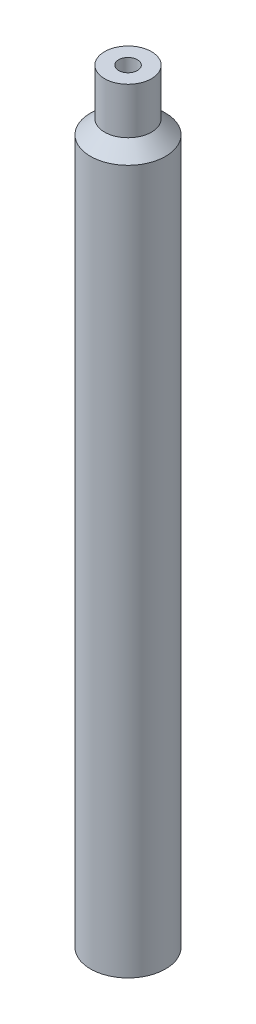
ISO-10303-21;
HEADER;
FILE_DESCRIPTION(('STEP AP214'),'2;1');
FILE_NAME('part.step','',(''),(''),'','','');
FILE_SCHEMA(('AUTOMOTIVE_DESIGN { 1 0 10303 214 1 1 1 1 }'));
ENDSEC;
DATA;
#1=APPLICATION_CONTEXT('core data for automotive mechanical design processes');
#2=APPLICATION_PROTOCOL_DEFINITION('international standard','automotive_design',2000,#1);
#3=PRODUCT_CONTEXT('',#1,'mechanical');
#4=PRODUCT('Part','Part','',(#3));
#5=PRODUCT_RELATED_PRODUCT_CATEGORY('part','',(#4));
#6=PRODUCT_DEFINITION_FORMATION('','',#4);
#7=PRODUCT_DEFINITION_CONTEXT('part definition',#1,'design');
#8=PRODUCT_DEFINITION('design','',#6,#7);
#9=PRODUCT_DEFINITION_SHAPE('','',#8);
#10=(LENGTH_UNIT() NAMED_UNIT(*) SI_UNIT(.MILLI.,.METRE.));
#11=(NAMED_UNIT(*) PLANE_ANGLE_UNIT() SI_UNIT($,.RADIAN.));
#12=(NAMED_UNIT(*) SI_UNIT($,.STERADIAN.) SOLID_ANGLE_UNIT());
#13=UNCERTAINTY_MEASURE_WITH_UNIT(LENGTH_MEASURE(1.E-05),#10,'distance_accuracy_value','');
#14=(GEOMETRIC_REPRESENTATION_CONTEXT(3) GLOBAL_UNCERTAINTY_ASSIGNED_CONTEXT((#13)) GLOBAL_UNIT_ASSIGNED_CONTEXT((#10,
#11,#12)) REPRESENTATION_CONTEXT('',''));
#15=CARTESIAN_POINT('',(0.,0.,0.));
#16=DIRECTION('',(0.,0.,1.));
#17=DIRECTION('',(1.,0.,0.));
#18=AXIS2_PLACEMENT_3D('',#15,#16,#17);
#19=CARTESIAN_POINT('',(0.,-19.3547762804855,0.));
#20=DIRECTION('',(0.,-1.,0.));
#21=DIRECTION('',(0.,0.,-1.));
#22=AXIS2_PLACEMENT_3D('',#19,#20,#21);
#23=CYLINDRICAL_SURFACE('',#22,5.);
#24=CARTESIAN_POINT('',(0.,0.,0.));
#25=DIRECTION('',(0.,-1.,0.));
#26=DIRECTION('',(0.,0.,-1.));
#27=AXIS2_PLACEMENT_3D('',#24,#25,#26);
#28=CIRCLE('',#27,5.);
#29=CARTESIAN_POINT('',(0.,0.,-5.));
#30=VERTEX_POINT('',#29);
#31=EDGE_CURVE('E61',#30,#30,#28,.T.);
#32=ORIENTED_EDGE('',*,*,#31,.T.);
#33=EDGE_LOOP('',(#32));
#34=FACE_BOUND('',#33,.T.);
#35=CARTESIAN_POINT('',(0.,150.,0.));
#36=DIRECTION('',(0.,-1.,0.));
#37=DIRECTION('',(0.,0.,-1.));
#38=AXIS2_PLACEMENT_3D('',#35,#36,#37);
#39=CIRCLE('',#38,5.);
#40=CARTESIAN_POINT('',(0.,150.,-5.));
#41=VERTEX_POINT('',#40);
#42=EDGE_CURVE('E10',#41,#41,#39,.T.);
#43=ORIENTED_EDGE('',*,*,#42,.F.);
#44=EDGE_LOOP('',(#43));
#45=FACE_BOUND('',#44,.T.);
#46=ADVANCED_FACE('F33',(#34,#45),#23,.F.);
#47=CARTESIAN_POINT('',(0.,152.96331719791,0.));
#48=DIRECTION('',(0.,-1.,0.));
#49=DIRECTION('',(0.,0.,-1.));
#50=AXIS2_PLACEMENT_3D('',#47,#48,#49);
#51=CONICAL_SURFACE('',#50,2.,0.791549494643532);
#52=ORIENTED_EDGE('',*,*,#42,.T.);
#53=EDGE_LOOP('',(#52));
#54=FACE_BOUND('',#53,.T.);
#55=CARTESIAN_POINT('',(0.,152.96331719791,0.));
#56=DIRECTION('',(0.,-1.,0.));
#57=DIRECTION('',(0.,0.,-1.));
#58=AXIS2_PLACEMENT_3D('',#55,#56,#57);
#59=CIRCLE('',#58,2.);
#60=CARTESIAN_POINT('',(0.,152.96331719791,-2.));
#61=VERTEX_POINT('',#60);
#62=EDGE_CURVE('E39',#61,#61,#59,.T.);
#63=ORIENTED_EDGE('',*,*,#62,.F.);
#64=EDGE_LOOP('',(#63));
#65=FACE_BOUND('',#64,.T.);
#66=ADVANCED_FACE('F79',(#54,#65),#51,.F.);
#67=CARTESIAN_POINT('',(0.,-19.3547762804855,0.));
#68=DIRECTION('',(0.,-1.,0.));
#69=DIRECTION('',(0.,0.,-1.));
#70=AXIS2_PLACEMENT_3D('',#67,#68,#69);
#71=CYLINDRICAL_SURFACE('',#70,2.);
#72=ORIENTED_EDGE('',*,*,#62,.T.);
#73=EDGE_LOOP('',(#72));
#74=FACE_BOUND('',#73,.T.);
#75=CARTESIAN_POINT('',(0.,162.83711147116,0.));
#76=DIRECTION('',(0.,-1.,0.));
#77=DIRECTION('',(0.,0.,-1.));
#78=AXIS2_PLACEMENT_3D('',#75,#76,#77);
#79=CIRCLE('',#78,2.);
#80=CARTESIAN_POINT('',(0.,162.83711147116,-2.));
#81=VERTEX_POINT('',#80);
#82=EDGE_CURVE('E43',#81,#81,#79,.T.);
#83=ORIENTED_EDGE('',*,*,#82,.F.);
#84=EDGE_LOOP('',(#83));
#85=FACE_BOUND('',#84,.T.);
#86=ADVANCED_FACE('F83',(#74,#85),#71,.F.);
#87=CARTESIAN_POINT('',(0.,162.83711147116,-2.));
#88=DIRECTION('',(0.,1.,0.));
#89=DIRECTION('',(0.,0.,1.));
#90=AXIS2_PLACEMENT_3D('',#87,#88,#89);
#91=PLANE('',#90);
#92=ORIENTED_EDGE('',*,*,#82,.T.);
#93=EDGE_LOOP('',(#92));
#94=FACE_BOUND('',#93,.T.);
#95=CARTESIAN_POINT('',(0.,162.83711147116,0.));
#96=DIRECTION('',(0.,-1.,0.));
#97=DIRECTION('',(0.,0.,-1.));
#98=AXIS2_PLACEMENT_3D('',#95,#96,#97);
#99=CIRCLE('',#98,5.);
#100=CARTESIAN_POINT('',(0.,162.83711147116,-5.));
#101=VERTEX_POINT('',#100);
#102=EDGE_CURVE('E47',#101,#101,#99,.T.);
#103=ORIENTED_EDGE('',*,*,#102,.F.);
#104=EDGE_LOOP('',(#103));
#105=FACE_BOUND('',#104,.T.);
#106=ADVANCED_FACE('F87',(#94,#105),#91,.T.);
#107=CARTESIAN_POINT('',(0.,-19.3547762804855,0.));
#108=DIRECTION('',(0.,-1.,0.));
#109=DIRECTION('',(0.,0.,-1.));
#110=AXIS2_PLACEMENT_3D('',#107,#108,#109);
#111=CYLINDRICAL_SURFACE('',#110,5.);
#112=ORIENTED_EDGE('',*,*,#102,.T.);
#113=EDGE_LOOP('',(#112));
#114=FACE_BOUND('',#113,.T.);
#115=CARTESIAN_POINT('',(0.,152.96331719791,0.));
#116=DIRECTION('',(0.,-1.,0.));
#117=DIRECTION('',(0.,0.,-1.));
#118=AXIS2_PLACEMENT_3D('',#115,#116,#117);
#119=CIRCLE('',#118,5.);
#120=CARTESIAN_POINT('',(0.,152.96331719791,-5.));
#121=VERTEX_POINT('',#120);
#122=EDGE_CURVE('E52',#121,#121,#119,.T.);
#123=ORIENTED_EDGE('',*,*,#122,.F.);
#124=EDGE_LOOP('',(#123));
#125=FACE_BOUND('',#124,.T.);
#126=ADVANCED_FACE('F93',(#114,#125),#111,.T.);
#127=CARTESIAN_POINT('',(0.,150.,0.));
#128=DIRECTION('',(0.,-1.,0.));
#129=DIRECTION('',(0.,0.,-1.));
#130=AXIS2_PLACEMENT_3D('',#127,#128,#129);
#131=CONICAL_SURFACE('',#130,8.,0.791549494643532);
#132=ORIENTED_EDGE('',*,*,#122,.T.);
#133=EDGE_LOOP('',(#132));
#134=FACE_BOUND('',#133,.T.);
#135=CARTESIAN_POINT('',(0.,150.,0.));
#136=DIRECTION('',(0.,-1.,0.));
#137=DIRECTION('',(0.,0.,-1.));
#138=AXIS2_PLACEMENT_3D('',#135,#136,#137);
#139=CIRCLE('',#138,8.);
#140=CARTESIAN_POINT('',(0.,150.,-8.));
#141=VERTEX_POINT('',#140);
#142=EDGE_CURVE('E55',#141,#141,#139,.T.);
#143=ORIENTED_EDGE('',*,*,#142,.F.);
#144=EDGE_LOOP('',(#143));
#145=FACE_BOUND('',#144,.T.);
#146=ADVANCED_FACE('F75',(#134,#145),#131,.T.);
#147=CARTESIAN_POINT('',(0.,-19.3547762804855,0.));
#148=DIRECTION('',(0.,-1.,0.));
#149=DIRECTION('',(0.,0.,-1.));
#150=AXIS2_PLACEMENT_3D('',#147,#148,#149);
#151=CYLINDRICAL_SURFACE('',#150,8.);
#152=ORIENTED_EDGE('',*,*,#142,.T.);
#153=EDGE_LOOP('',(#152));
#154=FACE_BOUND('',#153,.T.);
#155=CARTESIAN_POINT('',(0.,0.,0.));
#156=DIRECTION('',(0.,-1.,0.));
#157=DIRECTION('',(0.,0.,-1.));
#158=AXIS2_PLACEMENT_3D('',#155,#156,#157);
#159=CIRCLE('',#158,8.);
#160=CARTESIAN_POINT('',(0.,0.,-8.));
#161=VERTEX_POINT('',#160);
#162=EDGE_CURVE('E58',#161,#161,#159,.T.);
#163=ORIENTED_EDGE('',*,*,#162,.F.);
#164=EDGE_LOOP('',(#163));
#165=FACE_BOUND('',#164,.T.);
#166=ADVANCED_FACE('F69',(#154,#165),#151,.T.);
#167=CARTESIAN_POINT('',(0.,0.,-5.));
#168=DIRECTION('',(0.,-1.,0.));
#169=DIRECTION('',(0.,0.,-1.));
#170=AXIS2_PLACEMENT_3D('',#167,#168,#169);
#171=PLANE('',#170);
#172=ORIENTED_EDGE('',*,*,#162,.T.);
#173=EDGE_LOOP('',(#172));
#174=FACE_BOUND('',#173,.T.);
#175=ORIENTED_EDGE('',*,*,#31,.F.);
#176=EDGE_LOOP('',(#175));
#177=FACE_BOUND('',#176,.T.);
#178=ADVANCED_FACE('F67',(#174,#177),#171,.T.);
#179=CLOSED_SHELL('',(#46,#66,#86,#106,#126,#146,#166,#178));
#180=MANIFOLD_SOLID_BREP('B2',#179);
#181=ADVANCED_BREP_SHAPE_REPRESENTATION('',(#18,#180),#14);
#182=SHAPE_DEFINITION_REPRESENTATION(#9,#181);
ENDSEC;
END-ISO-10303-21;
